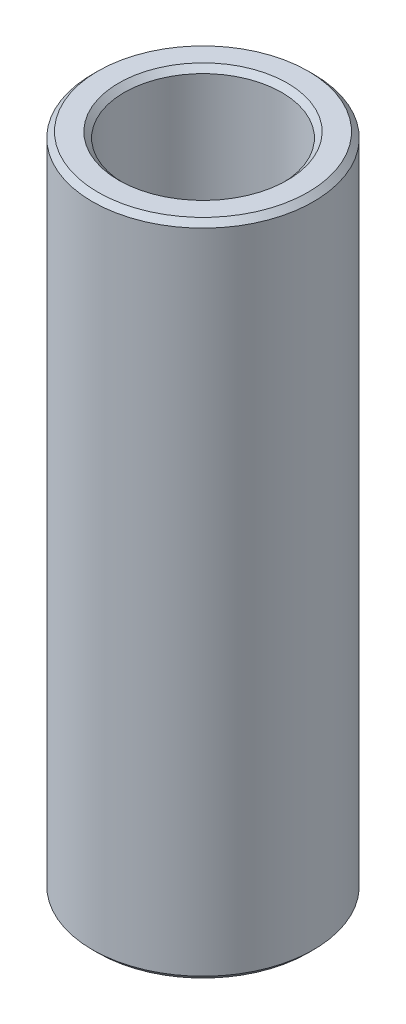
ISO-10303-21;
HEADER;
FILE_DESCRIPTION(('STEP AP214'),'2;1');
FILE_NAME('part.step','',(''),(''),'','','');
FILE_SCHEMA(('AUTOMOTIVE_DESIGN { 1 0 10303 214 1 1 1 1 }'));
ENDSEC;
DATA;
#1=APPLICATION_CONTEXT('core data for automotive mechanical design processes');
#2=APPLICATION_PROTOCOL_DEFINITION('international standard','automotive_design',2000,#1);
#3=PRODUCT_CONTEXT('',#1,'mechanical');
#4=PRODUCT('Part','Part','',(#3));
#5=PRODUCT_RELATED_PRODUCT_CATEGORY('part','',(#4));
#6=PRODUCT_DEFINITION_FORMATION('','',#4);
#7=PRODUCT_DEFINITION_CONTEXT('part definition',#1,'design');
#8=PRODUCT_DEFINITION('design','',#6,#7);
#9=PRODUCT_DEFINITION_SHAPE('','',#8);
#10=(LENGTH_UNIT() NAMED_UNIT(*) SI_UNIT(.MILLI.,.METRE.));
#11=(NAMED_UNIT(*) PLANE_ANGLE_UNIT() SI_UNIT($,.RADIAN.));
#12=(NAMED_UNIT(*) SI_UNIT($,.STERADIAN.) SOLID_ANGLE_UNIT());
#13=UNCERTAINTY_MEASURE_WITH_UNIT(LENGTH_MEASURE(1.E-05),#10,'distance_accuracy_value','');
#14=(GEOMETRIC_REPRESENTATION_CONTEXT(3) GLOBAL_UNCERTAINTY_ASSIGNED_CONTEXT((#13)) GLOBAL_UNIT_ASSIGNED_CONTEXT((#10,
#11,#12)) REPRESENTATION_CONTEXT('',''));
#15=CARTESIAN_POINT('',(0.,0.,0.));
#16=DIRECTION('',(0.,0.,1.));
#17=DIRECTION('',(1.,0.,0.));
#18=AXIS2_PLACEMENT_3D('',#15,#16,#17);
#19=CARTESIAN_POINT('',(0.,74.5250232178912,0.));
#20=DIRECTION('',(0.,-1.,0.));
#21=DIRECTION('',(0.,0.,-1.));
#22=AXIS2_PLACEMENT_3D('',#19,#20,#21);
#23=CYLINDRICAL_SURFACE('',#22,12.5);
#24=CARTESIAN_POINT('',(0.,0.618013124984176,0.));
#25=DIRECTION('',(0.,1.,0.));
#26=DIRECTION('',(0.,0.,1.));
#27=AXIS2_PLACEMENT_3D('',#24,#25,#26);
#28=CIRCLE('',#27,12.5);
#29=CARTESIAN_POINT('',(0.,0.618013124984162,-12.5));
#30=VERTEX_POINT('',#29);
#31=EDGE_CURVE('E10',#30,#30,#28,.T.);
#32=CARTESIAN_POINT('',(0.,73.9070100929072,0.));
#33=DIRECTION('',(0.,1.,0.));
#34=DIRECTION('',(0.,0.,1.));
#35=AXIS2_PLACEMENT_3D('',#32,#33,#34);
#36=CIRCLE('',#35,12.5);
#37=CARTESIAN_POINT('',(0.,73.9070100929072,-12.5));
#38=VERTEX_POINT('',#37);
#39=EDGE_CURVE('E50',#38,#38,#36,.F.);
#40=CARTESIAN_POINT('',(0.,0.618013124984162,-12.5));
#41=CARTESIAN_POINT('',(0.,1.38144017673336,-12.5));
#42=CARTESIAN_POINT('',(0.,2.14486722848256,-12.5));
#43=CARTESIAN_POINT('',(0.,3.67172133198096,-12.5));
#44=CARTESIAN_POINT('',(0.,4.43514838373016,-12.5));
#45=CARTESIAN_POINT('',(0.,5.96200248722855,-12.5));
#46=CARTESIAN_POINT('',(0.,6.72542953897775,-12.5));
#47=CARTESIAN_POINT('',(0.,8.25228364247614,-12.5));
#48=CARTESIAN_POINT('',(0.,9.01571069422534,-12.5));
#49=CARTESIAN_POINT('',(0.,10.5425647977237,-12.5));
#50=CARTESIAN_POINT('',(0.,11.3059918494729,-12.5));
#51=CARTESIAN_POINT('',(0.,12.8328459529713,-12.5));
#52=CARTESIAN_POINT('',(0.,13.5962730047205,-12.5));
#53=CARTESIAN_POINT('',(0.,15.1231271082189,-12.5));
#54=CARTESIAN_POINT('',(0.,15.8865541599681,-12.5));
#55=CARTESIAN_POINT('',(0.,17.4134082634665,-12.5));
#56=CARTESIAN_POINT('',(0.,18.1768353152157,-12.5));
#57=CARTESIAN_POINT('',(0.,19.7036894187141,-12.5));
#58=CARTESIAN_POINT('',(0.,20.4671164704633,-12.5));
#59=CARTESIAN_POINT('',(0.,21.9939705739617,-12.5));
#60=CARTESIAN_POINT('',(0.,22.7573976257109,-12.5));
#61=CARTESIAN_POINT('',(0.,24.2842517292093,-12.5));
#62=CARTESIAN_POINT('',(0.,25.0476787809585,-12.5));
#63=CARTESIAN_POINT('',(0.,26.5745328844569,-12.5));
#64=CARTESIAN_POINT('',(0.,27.3379599362061,-12.5));
#65=CARTESIAN_POINT('',(0.,28.8648140397045,-12.5));
#66=CARTESIAN_POINT('',(0.,29.6282410914537,-12.5));
#67=CARTESIAN_POINT('',(0.,31.1550951949521,-12.5));
#68=CARTESIAN_POINT('',(0.,31.9185222467013,-12.5));
#69=CARTESIAN_POINT('',(0.,33.4453763501997,-12.5));
#70=CARTESIAN_POINT('',(0.,34.2088034019489,-12.5));
#71=CARTESIAN_POINT('',(0.,35.7356575054473,-12.5));
#72=CARTESIAN_POINT('',(0.,36.4990845571965,-12.5));
#73=CARTESIAN_POINT('',(0.,38.0259386606949,-12.5));
#74=CARTESIAN_POINT('',(0.,38.7893657124441,-12.5));
#75=CARTESIAN_POINT('',(0.,40.3162198159425,-12.5));
#76=CARTESIAN_POINT('',(0.,41.0796468676917,-12.5));
#77=CARTESIAN_POINT('',(0.,42.60650097119,-12.5));
#78=CARTESIAN_POINT('',(0.,43.3699280229392,-12.5));
#79=CARTESIAN_POINT('',(0.,44.8967821264376,-12.5));
#80=CARTESIAN_POINT('',(0.,45.6602091781868,-12.5));
#81=CARTESIAN_POINT('',(0.,47.1870632816852,-12.5));
#82=CARTESIAN_POINT('',(0.,47.9504903334344,-12.5));
#83=CARTESIAN_POINT('',(0.,49.4773444369328,-12.5));
#84=CARTESIAN_POINT('',(0.,50.240771488682,-12.5));
#85=CARTESIAN_POINT('',(0.,51.7676255921804,-12.5));
#86=CARTESIAN_POINT('',(0.,52.5310526439296,-12.5));
#87=CARTESIAN_POINT('',(0.,54.057906747428,-12.5));
#88=CARTESIAN_POINT('',(0.,54.8213337991772,-12.5));
#89=CARTESIAN_POINT('',(0.,56.3481879026756,-12.5));
#90=CARTESIAN_POINT('',(0.,57.1116149544248,-12.5));
#91=CARTESIAN_POINT('',(0.,58.6384690579232,-12.5));
#92=CARTESIAN_POINT('',(0.,59.4018961096724,-12.5));
#93=CARTESIAN_POINT('',(0.,60.9287502131708,-12.5));
#94=CARTESIAN_POINT('',(0.,61.69217726492,-12.5));
#95=CARTESIAN_POINT('',(0.,63.2190313684184,-12.5));
#96=CARTESIAN_POINT('',(0.,63.9824584201676,-12.5));
#97=CARTESIAN_POINT('',(0.,65.509312523666,-12.5));
#98=CARTESIAN_POINT('',(0.,66.2727395754152,-12.5));
#99=CARTESIAN_POINT('',(0.,67.7995936789136,-12.5));
#100=CARTESIAN_POINT('',(0.,68.5630207306628,-12.5));
#101=CARTESIAN_POINT('',(0.,70.0898748341612,-12.5));
#102=CARTESIAN_POINT('',(0.,70.8533018859104,-12.5));
#103=CARTESIAN_POINT('',(0.,72.3801559894088,-12.5));
#104=CARTESIAN_POINT('',(0.,73.143583041158,-12.5));
#105=CARTESIAN_POINT('',(0.,73.9070100929072,-12.5));
#106=B_SPLINE_CURVE_WITH_KNOTS('',3,(#40,#41,#42,#43,#44,#45,#46,#47,#48,#49,#50,#51,#52,#53,
#54,#55,#56,#57,#58,#59,#60,#61,#62,#63,#64,#65,#66,#67,#68,#69,#70,#71,#72,#73,#74,#75,#76,#77,
#78,#79,#80,#81,#82,#83,#84,#85,#86,#87,#88,#89,#90,#91,#92,#93,#94,#95,#96,#97,#98,#99,#100,
#101,#102,#103,#104,#105),.UNSPECIFIED.,.F.,.F.,(4,2,2,2,2,2,2,2,2,2,2,2,2,2,2,2,2,2,2,2,2,2,2,
2,2,2,2,2,2,2,2,2,4),(0.,2.2902811552476,4.5805623104952,6.87084346574278,9.16112462099038,
11.451405776238,13.7416869314856,16.0319680867331,18.3222492419807,20.6125303972283,
22.9028115524759,25.1930927077235,27.4833738629711,29.7736550182187,32.0639361734663,
34.3542173287139,36.6444984839615,38.9347796392091,41.2250607944567,43.5153419497043,
45.8056231049519,48.0959042601995,50.3861854154471,52.6764665706947,54.9667477259422,
57.2570288811898,59.5473100364374,61.837591191685,64.1278723469326,66.4181535021802,
68.7084346574278,70.9987158126754,73.288996967923),.UNSPECIFIED.);
#107=EDGE_CURVE('BSEAM39',#30,#38,#106,.T.);
#108=ORIENTED_EDGE('',*,*,#31,.T.);
#109=ORIENTED_EDGE('',*,*,#39,.T.);
#110=ORIENTED_EDGE('',*,*,#107,.T.);
#111=ORIENTED_EDGE('',*,*,#107,.F.);
#112=EDGE_LOOP('',(#108,#110,#109,#111));
#113=FACE_BOUND('',#112,.T.);
#114=ADVANCED_FACE('F39',(#113),#23,.T.);
#115=CARTESIAN_POINT('',(0.,74.5250232178912,0.));
#116=DIRECTION('',(0.,1.,0.));
#117=DIRECTION('',(0.,0.,1.));
#118=AXIS2_PLACEMENT_3D('',#115,#116,#117);
#119=PLANE('',#118);
#120=CARTESIAN_POINT('',(0.,74.5250232178912,0.));
#121=DIRECTION('',(0.,1.,0.));
#122=DIRECTION('',(0.,0.,1.));
#123=AXIS2_PLACEMENT_3D('',#120,#121,#122);
#124=CIRCLE('',#123,9.53363947154152);
#125=CARTESIAN_POINT('',(0.,74.5250232178912,9.53363947154152));
#126=VERTEX_POINT('',#125);
#127=EDGE_CURVE('E58',#126,#126,#124,.F.);
#128=ORIENTED_EDGE('',*,*,#127,.T.);
#129=EDGE_LOOP('',(#128));
#130=FACE_BOUND('',#129,.T.);
#131=CARTESIAN_POINT('',(0.,74.5250232178912,0.));
#132=DIRECTION('',(0.,1.,0.));
#133=DIRECTION('',(0.,0.,1.));
#134=AXIS2_PLACEMENT_3D('',#131,#132,#133);
#135=CIRCLE('',#134,11.8819868750159);
#136=CARTESIAN_POINT('',(0.,74.5250232178912,11.8819868750159));
#137=VERTEX_POINT('',#136);
#138=EDGE_CURVE('E61',#137,#137,#135,.T.);
#139=ORIENTED_EDGE('',*,*,#138,.T.);
#140=EDGE_LOOP('',(#139));
#141=FACE_BOUND('',#140,.T.);
#142=ADVANCED_FACE('F88',(#130,#141),#119,.T.);
#143=CARTESIAN_POINT('',(0.,0.,0.));
#144=DIRECTION('',(0.,1.,0.));
#145=DIRECTION('',(0.,0.,1.));
#146=AXIS2_PLACEMENT_3D('',#143,#144,#145);
#147=PLANE('',#146);
#148=CARTESIAN_POINT('',(0.,0.,0.));
#149=DIRECTION('',(0.,1.,0.));
#150=DIRECTION('',(0.,0.,1.));
#151=AXIS2_PLACEMENT_3D('',#148,#149,#150);
#152=CIRCLE('',#151,9.53363947154145);
#153=CARTESIAN_POINT('',(0.,0.,9.53363947154145));
#154=VERTEX_POINT('',#153);
#155=EDGE_CURVE('E51',#154,#154,#152,.T.);
#156=ORIENTED_EDGE('',*,*,#155,.T.);
#157=EDGE_LOOP('',(#156));
#158=FACE_BOUND('',#157,.T.);
#159=CARTESIAN_POINT('',(0.,0.,0.));
#160=DIRECTION('',(0.,1.,0.));
#161=DIRECTION('',(0.,0.,1.));
#162=AXIS2_PLACEMENT_3D('',#159,#160,#161);
#163=CIRCLE('',#162,11.8819868750158);
#164=CARTESIAN_POINT('',(0.,0.,11.8819868750158));
#165=VERTEX_POINT('',#164);
#166=EDGE_CURVE('E54',#165,#165,#163,.F.);
#167=ORIENTED_EDGE('',*,*,#166,.T.);
#168=EDGE_LOOP('',(#167));
#169=FACE_BOUND('',#168,.T.);
#170=ADVANCED_FACE('F83',(#158,#169),#147,.F.);
#171=CARTESIAN_POINT('',(0.,74.5250232178912,0.));
#172=DIRECTION('',(0.,-1.,0.));
#173=DIRECTION('',(0.,0.,-1.));
#174=AXIS2_PLACEMENT_3D('',#171,#172,#173);
#175=CYLINDRICAL_SURFACE('',#174,8.91562634655735);
#176=CARTESIAN_POINT('',(0.,73.9070100929071,0.));
#177=DIRECTION('',(0.,1.,0.));
#178=DIRECTION('',(0.,0.,1.));
#179=AXIS2_PLACEMENT_3D('',#176,#177,#178);
#180=CIRCLE('',#179,8.91562634655735);
#181=CARTESIAN_POINT('',(0.,73.9070100929071,-8.91562634655735));
#182=VERTEX_POINT('',#181);
#183=EDGE_CURVE('E67',#182,#182,#180,.T.);
#184=CARTESIAN_POINT('',(0.,0.618013124984093,0.));
#185=DIRECTION('',(0.,1.,0.));
#186=DIRECTION('',(0.,0.,1.));
#187=AXIS2_PLACEMENT_3D('',#184,#185,#186);
#188=CIRCLE('',#187,8.91562634655735);
#189=CARTESIAN_POINT('',(0.,0.618013124984079,-8.91562634655735));
#190=VERTEX_POINT('',#189);
#191=EDGE_CURVE('E69',#190,#190,#188,.F.);
#192=CARTESIAN_POINT('',(0.,73.9070100929071,-8.91562634655735));
#193=CARTESIAN_POINT('',(0.,73.1435830411579,-8.91562634655735));
#194=CARTESIAN_POINT('',(0.,72.3801559894087,-8.91562634655735));
#195=CARTESIAN_POINT('',(0.,70.8533018859103,-8.91562634655735));
#196=CARTESIAN_POINT('',(0.,70.0898748341611,-8.91562634655735));
#197=CARTESIAN_POINT('',(0.,68.5630207306627,-8.91562634655735));
#198=CARTESIAN_POINT('',(0.,67.7995936789135,-8.91562634655735));
#199=CARTESIAN_POINT('',(0.,66.2727395754151,-8.91562634655735));
#200=CARTESIAN_POINT('',(0.,65.5093125236659,-8.91562634655735));
#201=CARTESIAN_POINT('',(0.,63.9824584201675,-8.91562634655735));
#202=CARTESIAN_POINT('',(0.,63.2190313684183,-8.91562634655735));
#203=CARTESIAN_POINT('',(0.,61.6921772649199,-8.91562634655735));
#204=CARTESIAN_POINT('',(0.,60.9287502131707,-8.91562634655735));
#205=CARTESIAN_POINT('',(0.,59.4018961096723,-8.91562634655735));
#206=CARTESIAN_POINT('',(0.,58.6384690579231,-8.91562634655735));
#207=CARTESIAN_POINT('',(0.,57.1116149544247,-8.91562634655735));
#208=CARTESIAN_POINT('',(0.,56.3481879026755,-8.91562634655735));
#209=CARTESIAN_POINT('',(0.,54.8213337991771,-8.91562634655735));
#210=CARTESIAN_POINT('',(0.,54.0579067474279,-8.91562634655735));
#211=CARTESIAN_POINT('',(0.,52.5310526439295,-8.91562634655735));
#212=CARTESIAN_POINT('',(0.,51.7676255921803,-8.91562634655735));
#213=CARTESIAN_POINT('',(0.,50.2407714886819,-8.91562634655735));
#214=CARTESIAN_POINT('',(0.,49.4773444369327,-8.91562634655735));
#215=CARTESIAN_POINT('',(0.,47.9504903334343,-8.91562634655735));
#216=CARTESIAN_POINT('',(0.,47.1870632816851,-8.91562634655735));
#217=CARTESIAN_POINT('',(0.,45.6602091781867,-8.91562634655735));
#218=CARTESIAN_POINT('',(0.,44.8967821264376,-8.91562634655735));
#219=CARTESIAN_POINT('',(0.,43.3699280229391,-8.91562634655735));
#220=CARTESIAN_POINT('',(0.,42.60650097119,-8.91562634655735));
#221=CARTESIAN_POINT('',(0.,41.0796468676916,-8.91562634655735));
#222=CARTESIAN_POINT('',(0.,40.3162198159424,-8.91562634655735));
#223=CARTESIAN_POINT('',(0.,38.789365712444,-8.91562634655735));
#224=CARTESIAN_POINT('',(0.,38.0259386606948,-8.91562634655735));
#225=CARTESIAN_POINT('',(0.,36.4990845571964,-8.91562634655735));
#226=CARTESIAN_POINT('',(0.,35.7356575054472,-8.91562634655735));
#227=CARTESIAN_POINT('',(0.,34.2088034019488,-8.91562634655735));
#228=CARTESIAN_POINT('',(0.,33.4453763501996,-8.91562634655735));
#229=CARTESIAN_POINT('',(0.,31.9185222467012,-8.91562634655735));
#230=CARTESIAN_POINT('',(0.,31.155095194952,-8.91562634655735));
#231=CARTESIAN_POINT('',(0.,29.6282410914536,-8.91562634655735));
#232=CARTESIAN_POINT('',(0.,28.8648140397044,-8.91562634655735));
#233=CARTESIAN_POINT('',(0.,27.337959936206,-8.91562634655735));
#234=CARTESIAN_POINT('',(0.,26.5745328844568,-8.91562634655735));
#235=CARTESIAN_POINT('',(0.,25.0476787809584,-8.91562634655735));
#236=CARTESIAN_POINT('',(0.,24.2842517292092,-8.91562634655735));
#237=CARTESIAN_POINT('',(0.,22.7573976257108,-8.91562634655735));
#238=CARTESIAN_POINT('',(0.,21.9939705739616,-8.91562634655735));
#239=CARTESIAN_POINT('',(0.,20.4671164704632,-8.91562634655735));
#240=CARTESIAN_POINT('',(0.,19.703689418714,-8.91562634655735));
#241=CARTESIAN_POINT('',(0.,18.1768353152156,-8.91562634655735));
#242=CARTESIAN_POINT('',(0.,17.4134082634664,-8.91562634655735));
#243=CARTESIAN_POINT('',(0.,15.886554159968,-8.91562634655735));
#244=CARTESIAN_POINT('',(0.,15.1231271082188,-8.91562634655735));
#245=CARTESIAN_POINT('',(0.,13.5962730047204,-8.91562634655735));
#246=CARTESIAN_POINT('',(0.,12.8328459529712,-8.91562634655735));
#247=CARTESIAN_POINT('',(0.,11.3059918494728,-8.91562634655735));
#248=CARTESIAN_POINT('',(0.,10.5425647977237,-8.91562634655735));
#249=CARTESIAN_POINT('',(0.,9.01571069422526,-8.91562634655735));
#250=CARTESIAN_POINT('',(0.,8.25228364247606,-8.91562634655735));
#251=CARTESIAN_POINT('',(0.,6.72542953897766,-8.91562634655735));
#252=CARTESIAN_POINT('',(0.,5.96200248722846,-8.91562634655735));
#253=CARTESIAN_POINT('',(0.,4.43514838373007,-8.91562634655735));
#254=CARTESIAN_POINT('',(0.,3.67172133198087,-8.91562634655735));
#255=CARTESIAN_POINT('',(0.,2.14486722848248,-8.91562634655735));
#256=CARTESIAN_POINT('',(0.,1.38144017673328,-8.91562634655735));
#257=CARTESIAN_POINT('',(0.,0.618013124984079,-8.91562634655735));
#258=B_SPLINE_CURVE_WITH_KNOTS('',3,(#192,#193,#194,#195,#196,#197,#198,#199,#200,#201,#202,
#203,#204,#205,#206,#207,#208,#209,#210,#211,#212,#213,#214,#215,#216,#217,#218,#219,#220,#221,
#222,#223,#224,#225,#226,#227,#228,#229,#230,#231,#232,#233,#234,#235,#236,#237,#238,#239,#240,
#241,#242,#243,#244,#245,#246,#247,#248,#249,#250,#251,#252,#253,#254,#255,#256,#257),
.UNSPECIFIED.,.F.,.F.,(4,2,2,2,2,2,2,2,2,2,2,2,2,2,2,2,2,2,2,2,2,2,2,2,2,2,2,2,2,2,2,2,4),(0.,
2.29028115524758,4.58056231049518,6.87084346574278,9.16112462099036,11.451405776238,
13.7416869314856,16.0319680867331,18.3222492419807,20.6125303972283,22.9028115524759,
25.1930927077235,27.4833738629711,29.7736550182187,32.0639361734663,34.3542173287139,
36.6444984839615,38.9347796392091,41.2250607944567,43.5153419497043,45.8056231049519,
48.0959042601994,50.386185415447,52.6764665706946,54.9667477259422,57.2570288811898,
59.5473100364374,61.837591191685,64.1278723469326,66.4181535021802,68.7084346574278,
70.9987158126754,73.288996967923),.UNSPECIFIED.);
#259=EDGE_CURVE('BSEAM71',#182,#190,#258,.T.);
#260=ORIENTED_EDGE('',*,*,#183,.T.);
#261=ORIENTED_EDGE('',*,*,#191,.T.);
#262=ORIENTED_EDGE('',*,*,#259,.T.);
#263=ORIENTED_EDGE('',*,*,#259,.F.);
#264=EDGE_LOOP('',(#260,#262,#261,#263));
#265=FACE_BOUND('',#264,.T.);
#266=ADVANCED_FACE('F71',(#265),#175,.F.);
#267=CARTESIAN_POINT('',(0.,73.9070100929071,0.));
#268=DIRECTION('',(0.,1.,0.));
#269=DIRECTION('',(0.,0.,1.));
#270=AXIS2_PLACEMENT_3D('',#267,#268,#269);
#271=CONICAL_SURFACE('',#270,8.91562634655735,0.785398163397443);
#272=ORIENTED_EDGE('',*,*,#127,.F.);
#273=EDGE_LOOP('',(#272));
#274=FACE_BOUND('',#273,.T.);
#275=ORIENTED_EDGE('',*,*,#183,.F.);
#276=EDGE_LOOP('',(#275));
#277=FACE_BOUND('',#276,.T.);
#278=ADVANCED_FACE('F77',(#274,#277),#271,.F.);
#279=CARTESIAN_POINT('',(0.,0.,0.));
#280=DIRECTION('',(0.,-1.,0.));
#281=DIRECTION('',(0.,0.,-1.));
#282=AXIS2_PLACEMENT_3D('',#279,#280,#281);
#283=CONICAL_SURFACE('',#282,9.53363947154145,0.785398163397448);
#284=ORIENTED_EDGE('',*,*,#191,.F.);
#285=EDGE_LOOP('',(#284));
#286=FACE_BOUND('',#285,.T.);
#287=ORIENTED_EDGE('',*,*,#155,.F.);
#288=EDGE_LOOP('',(#287));
#289=FACE_BOUND('',#288,.T.);
#290=ADVANCED_FACE('F73',(#286,#289),#283,.F.);
#291=CARTESIAN_POINT('',(0.,0.618013124984176,0.));
#292=DIRECTION('',(0.,1.,0.));
#293=DIRECTION('',(0.,0.,1.));
#294=AXIS2_PLACEMENT_3D('',#291,#292,#293);
#295=CONICAL_SURFACE('',#294,12.5,0.785398163397447);
#296=ORIENTED_EDGE('',*,*,#166,.F.);
#297=EDGE_LOOP('',(#296));
#298=FACE_BOUND('',#297,.T.);
#299=ORIENTED_EDGE('',*,*,#31,.F.);
#300=EDGE_LOOP('',(#299));
#301=FACE_BOUND('',#300,.T.);
#302=ADVANCED_FACE('F76',(#298,#301),#295,.T.);
#303=CARTESIAN_POINT('',(0.,74.5250232178912,0.));
#304=DIRECTION('',(0.,-1.,0.));
#305=DIRECTION('',(0.,0.,-1.));
#306=AXIS2_PLACEMENT_3D('',#303,#304,#305);
#307=CONICAL_SURFACE('',#306,11.8819868750159,0.785398163397452);
#308=ORIENTED_EDGE('',*,*,#39,.F.);
#309=EDGE_LOOP('',(#308));
#310=FACE_BOUND('',#309,.T.);
#311=ORIENTED_EDGE('',*,*,#138,.F.);
#312=EDGE_LOOP('',(#311));
#313=FACE_BOUND('',#312,.T.);
#314=ADVANCED_FACE('F45',(#310,#313),#307,.T.);
#315=CLOSED_SHELL('',(#114,#142,#170,#266,#278,#290,#302,#314));
#316=MANIFOLD_SOLID_BREP('B2',#315);
#317=ADVANCED_BREP_SHAPE_REPRESENTATION('',(#18,#316),#14);
#318=SHAPE_DEFINITION_REPRESENTATION(#9,#317);
ENDSEC;
END-ISO-10303-21;
